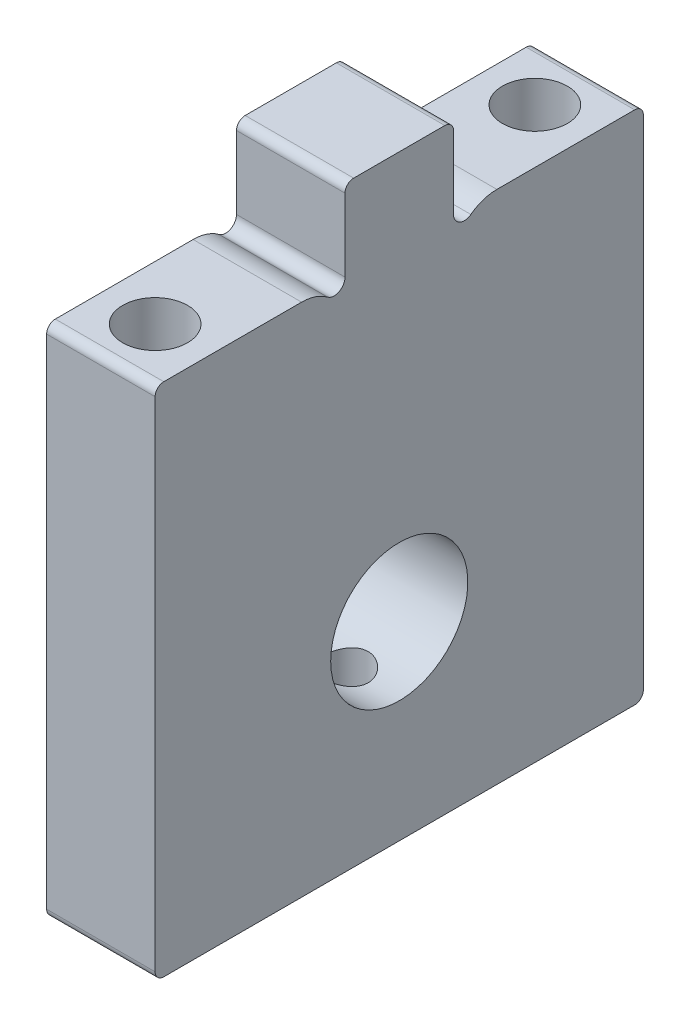
ISO-10303-21;
HEADER;
FILE_DESCRIPTION(('STEP AP214'),'2;1');
FILE_NAME('part.step','',(''),(''),'','','');
FILE_SCHEMA(('AUTOMOTIVE_DESIGN { 1 0 10303 214 1 1 1 1 }'));
ENDSEC;
DATA;
#1=APPLICATION_CONTEXT('core data for automotive mechanical design processes');
#2=APPLICATION_PROTOCOL_DEFINITION('international standard','automotive_design',2000,#1);
#3=PRODUCT_CONTEXT('',#1,'mechanical');
#4=PRODUCT('Part','Part','',(#3));
#5=PRODUCT_RELATED_PRODUCT_CATEGORY('part','',(#4));
#6=PRODUCT_DEFINITION_FORMATION('','',#4);
#7=PRODUCT_DEFINITION_CONTEXT('part definition',#1,'design');
#8=PRODUCT_DEFINITION('design','',#6,#7);
#9=PRODUCT_DEFINITION_SHAPE('','',#8);
#10=(LENGTH_UNIT() NAMED_UNIT(*) SI_UNIT(.MILLI.,.METRE.));
#11=(NAMED_UNIT(*) PLANE_ANGLE_UNIT() SI_UNIT($,.RADIAN.));
#12=(NAMED_UNIT(*) SI_UNIT($,.STERADIAN.) SOLID_ANGLE_UNIT());
#13=UNCERTAINTY_MEASURE_WITH_UNIT(LENGTH_MEASURE(1.E-05),#10,'distance_accuracy_value','');
#14=(GEOMETRIC_REPRESENTATION_CONTEXT(3) GLOBAL_UNCERTAINTY_ASSIGNED_CONTEXT((#13)) GLOBAL_UNIT_ASSIGNED_CONTEXT((#10,
#11,#12)) REPRESENTATION_CONTEXT('',''));
#15=CARTESIAN_POINT('',(0.,0.,0.));
#16=DIRECTION('',(0.,0.,1.));
#17=DIRECTION('',(1.,0.,0.));
#18=AXIS2_PLACEMENT_3D('',#15,#16,#17);
#19=CARTESIAN_POINT('',(0.,19.05,0.));
#20=DIRECTION('',(0.,1.,0.));
#21=DIRECTION('',(0.,0.,1.));
#22=AXIS2_PLACEMENT_3D('',#19,#20,#21);
#23=PLANE('',#22);
#24=DIRECTION('',(0.,0.,-1.));
#25=VECTOR('',#24,1.);
#26=CARTESIAN_POINT('',(-33.3375,19.05,-12.7));
#27=LINE('',#26,#25);
#28=CARTESIAN_POINT('',(-33.3375,19.05,13.7795));
#29=VERTEX_POINT('',#28);
#30=CARTESIAN_POINT('',(-33.3375,19.05,5.715));
#31=VERTEX_POINT('',#30);
#32=EDGE_CURVE('E218',#29,#31,#27,.T.);
#33=ORIENTED_EDGE('',*,*,#32,.F.);
#34=DIRECTION('',(-1.,0.,0.));
#35=VECTOR('',#34,1.);
#36=CARTESIAN_POINT('',(0.,19.05,13.7795));
#37=LINE('',#36,#35);
#38=CARTESIAN_POINT('',(-26.9875,19.05,13.7795));
#39=VERTEX_POINT('',#38);
#40=EDGE_CURVE('E280',#29,#39,#37,.F.);
#41=ORIENTED_EDGE('',*,*,#40,.T.);
#42=DIRECTION('',(0.,0.,1.));
#43=VECTOR('',#42,1.);
#44=CARTESIAN_POINT('',(-26.9875,19.05,-12.7));
#45=LINE('',#44,#43);
#46=CARTESIAN_POINT('',(-26.9875,19.05,5.715));
#47=VERTEX_POINT('',#46);
#48=EDGE_CURVE('E213',#47,#39,#45,.T.);
#49=ORIENTED_EDGE('',*,*,#48,.F.);
#50=DIRECTION('',(1.,0.,0.));
#51=VECTOR('',#50,1.);
#52=CARTESIAN_POINT('',(-33.3375,19.05,5.715));
#53=LINE('',#52,#51);
#54=EDGE_CURVE('E240',#47,#31,#53,.F.);
#55=ORIENTED_EDGE('',*,*,#54,.T.);
#56=EDGE_LOOP('',(#33,#41,#49,#55));
#57=FACE_BOUND('',#56,.T.);
#58=CARTESIAN_POINT('',(-30.1625,19.05,11.1125));
#59=DIRECTION('',(0.,1.,0.));
#60=DIRECTION('',(0.,0.,1.));
#61=AXIS2_PLACEMENT_3D('',#58,#59,#60);
#62=CIRCLE('',#61,1.89865);
#63=CARTESIAN_POINT('',(-30.1625,19.05,13.01115));
#64=VERTEX_POINT('',#63);
#65=EDGE_CURVE('E319',#64,#64,#62,.F.);
#66=ORIENTED_EDGE('',*,*,#65,.T.);
#67=EDGE_LOOP('',(#66));
#68=FACE_BOUND('',#67,.T.);
#69=ADVANCED_FACE('F36',(#57,#68),#23,.T.);
#70=CARTESIAN_POINT('',(-26.9875,-11.1125,-12.7));
#71=DIRECTION('',(-1.,0.,0.));
#72=DIRECTION('',(0.,0.,1.));
#73=AXIS2_PLACEMENT_3D('',#70,#71,#72);
#74=PLANE('',#73);
#75=CARTESIAN_POINT('',(-26.9875,0.,0.));
#76=DIRECTION('',(-1.,0.,0.));
#77=DIRECTION('',(0.,0.,1.));
#78=AXIS2_PLACEMENT_3D('',#75,#76,#77);
#79=CIRCLE('',#78,4.0127);
#80=CARTESIAN_POINT('',(-26.9875,0.,4.0127));
#81=VERTEX_POINT('',#80);
#82=EDGE_CURVE('E343',#81,#81,#79,.T.);
#83=ORIENTED_EDGE('',*,*,#82,.T.);
#84=EDGE_LOOP('',(#83));
#85=FACE_BOUND('',#84,.T.);
#86=DIRECTION('',(0.,-1.,0.));
#87=VECTOR('',#86,1.);
#88=CARTESIAN_POINT('',(-26.9875,19.05,14.2875));
#89=LINE('',#88,#87);
#90=CARTESIAN_POINT('',(-26.9875,18.542,14.2875));
#91=VERTEX_POINT('',#90);
#92=CARTESIAN_POINT('',(-26.9875,-10.6045,14.2875));
#93=VERTEX_POINT('',#92);
#94=EDGE_CURVE('E314',#91,#93,#89,.T.);
#95=ORIENTED_EDGE('',*,*,#94,.T.);
#96=CARTESIAN_POINT('',(-26.9875,-10.6045,13.7795));
#97=DIRECTION('',(-1.,0.,0.));
#98=DIRECTION('',(0.,0.,1.));
#99=AXIS2_PLACEMENT_3D('',#96,#97,#98);
#100=CIRCLE('',#99,0.508);
#101=CARTESIAN_POINT('',(-26.9875,-11.1125,13.7795));
#102=VERTEX_POINT('',#101);
#103=EDGE_CURVE('E274',#93,#102,#100,.F.);
#104=ORIENTED_EDGE('',*,*,#103,.T.);
#105=DIRECTION('',(0.,0.,1.));
#106=VECTOR('',#105,1.);
#107=CARTESIAN_POINT('',(-26.9875,-11.1125,-12.7));
#108=LINE('',#107,#106);
#109=CARTESIAN_POINT('',(-26.9875,-11.1125,-13.7795));
#110=VERTEX_POINT('',#109);
#111=EDGE_CURVE('E214',#110,#102,#108,.T.);
#112=ORIENTED_EDGE('',*,*,#111,.F.);
#113=CARTESIAN_POINT('',(-26.9875,-10.6045,-13.7795));
#114=DIRECTION('',(-1.,0.,0.));
#115=DIRECTION('',(0.,0.,1.));
#116=AXIS2_PLACEMENT_3D('',#113,#114,#115);
#117=CIRCLE('',#116,0.508);
#118=CARTESIAN_POINT('',(-26.9875,-10.6045,-14.2875));
#119=VERTEX_POINT('',#118);
#120=EDGE_CURVE('E64',#110,#119,#117,.F.);
#121=ORIENTED_EDGE('',*,*,#120,.T.);
#122=DIRECTION('',(0.,1.,0.));
#123=VECTOR('',#122,1.);
#124=CARTESIAN_POINT('',(-26.9875,-11.1125,-14.2875));
#125=LINE('',#124,#123);
#126=CARTESIAN_POINT('',(-26.9875,18.542,-14.2875));
#127=VERTEX_POINT('',#126);
#128=EDGE_CURVE('E197',#119,#127,#125,.T.);
#129=ORIENTED_EDGE('',*,*,#128,.T.);
#130=CARTESIAN_POINT('',(-26.9875,18.542,-13.7795));
#131=DIRECTION('',(-1.,0.,0.));
#132=DIRECTION('',(0.,0.,1.));
#133=AXIS2_PLACEMENT_3D('',#130,#131,#132);
#134=CIRCLE('',#133,0.508);
#135=CARTESIAN_POINT('',(-26.9875,19.05,-13.7795));
#136=VERTEX_POINT('',#135);
#137=EDGE_CURVE('E265',#127,#136,#134,.F.);
#138=ORIENTED_EDGE('',*,*,#137,.T.);
#139=CARTESIAN_POINT('',(-26.9875,19.05,-5.715));
#140=VERTEX_POINT('',#139);
#141=EDGE_CURVE('E222',#136,#140,#45,.T.);
#142=ORIENTED_EDGE('',*,*,#141,.T.);
#143=CARTESIAN_POINT('',(-26.9875,16.51,-5.715));
#144=DIRECTION('',(-1.,0.,0.));
#145=DIRECTION('',(0.,0.,1.));
#146=AXIS2_PLACEMENT_3D('',#143,#144,#145);
#147=CIRCLE('',#146,2.54);
#148=CARTESIAN_POINT('',(-26.9875,18.542,-4.191));
#149=VERTEX_POINT('',#148);
#150=EDGE_CURVE('E236',#140,#149,#147,.F.);
#151=ORIENTED_EDGE('',*,*,#150,.T.);
#152=CARTESIAN_POINT('',(-26.9875,19.05,-3.81));
#153=DIRECTION('',(-1.,0.,0.));
#154=DIRECTION('',(0.,0.,1.));
#155=AXIS2_PLACEMENT_3D('',#152,#153,#154);
#156=CIRCLE('',#155,0.635);
#157=CARTESIAN_POINT('',(-26.9875,19.05,-3.175));
#158=VERTEX_POINT('',#157);
#159=EDGE_CURVE('E301',#149,#158,#156,.T.);
#160=ORIENTED_EDGE('',*,*,#159,.T.);
#161=DIRECTION('',(0.,1.,0.));
#162=VECTOR('',#161,1.);
#163=CARTESIAN_POINT('',(-26.9875,23.8125,-3.175));
#164=LINE('',#163,#162);
#165=CARTESIAN_POINT('',(-26.9875,23.3045,-3.175));
#166=VERTEX_POINT('',#165);
#167=EDGE_CURVE('E204',#158,#166,#164,.T.);
#168=ORIENTED_EDGE('',*,*,#167,.T.);
#169=CARTESIAN_POINT('',(-26.9875,23.3045,-2.667));
#170=DIRECTION('',(-1.,0.,0.));
#171=DIRECTION('',(0.,0.,1.));
#172=AXIS2_PLACEMENT_3D('',#169,#170,#171);
#173=CIRCLE('',#172,0.508);
#174=CARTESIAN_POINT('',(-26.9875,23.8125,-2.667));
#175=VERTEX_POINT('',#174);
#176=EDGE_CURVE('E267',#166,#175,#173,.F.);
#177=ORIENTED_EDGE('',*,*,#176,.T.);
#178=DIRECTION('',(0.,0.,1.));
#179=VECTOR('',#178,1.);
#180=CARTESIAN_POINT('',(-26.9875,23.8125,3.175));
#181=LINE('',#180,#179);
#182=CARTESIAN_POINT('',(-26.9875,23.8125,2.667));
#183=VERTEX_POINT('',#182);
#184=EDGE_CURVE('E209',#175,#183,#181,.T.);
#185=ORIENTED_EDGE('',*,*,#184,.T.);
#186=CARTESIAN_POINT('',(-26.9875,23.3045,2.667));
#187=DIRECTION('',(-1.,0.,0.));
#188=DIRECTION('',(0.,0.,1.));
#189=AXIS2_PLACEMENT_3D('',#186,#187,#188);
#190=CIRCLE('',#189,0.508);
#191=CARTESIAN_POINT('',(-26.9875,23.3045,3.175));
#192=VERTEX_POINT('',#191);
#193=EDGE_CURVE('E269',#183,#192,#190,.F.);
#194=ORIENTED_EDGE('',*,*,#193,.T.);
#195=DIRECTION('',(0.,-1.,0.));
#196=VECTOR('',#195,1.);
#197=CARTESIAN_POINT('',(-26.9875,19.05,3.175));
#198=LINE('',#197,#196);
#199=CARTESIAN_POINT('',(-26.9875,19.05,3.175));
#200=VERTEX_POINT('',#199);
#201=EDGE_CURVE('E211',#192,#200,#198,.T.);
#202=ORIENTED_EDGE('',*,*,#201,.T.);
#203=CARTESIAN_POINT('',(-26.9875,19.05,3.81));
#204=DIRECTION('',(-1.,0.,0.));
#205=DIRECTION('',(0.,0.,1.));
#206=AXIS2_PLACEMENT_3D('',#203,#204,#205);
#207=CIRCLE('',#206,0.635);
#208=CARTESIAN_POINT('',(-26.9875,18.542,4.191));
#209=VERTEX_POINT('',#208);
#210=EDGE_CURVE('E177',#200,#209,#207,.T.);
#211=ORIENTED_EDGE('',*,*,#210,.T.);
#212=CARTESIAN_POINT('',(-26.9875,16.51,5.715));
#213=DIRECTION('',(-1.,0.,0.));
#214=DIRECTION('',(0.,0.,1.));
#215=AXIS2_PLACEMENT_3D('',#212,#213,#214);
#216=CIRCLE('',#215,2.54);
#217=EDGE_CURVE('E234',#209,#47,#216,.F.);
#218=ORIENTED_EDGE('',*,*,#217,.T.);
#219=ORIENTED_EDGE('',*,*,#48,.T.);
#220=CARTESIAN_POINT('',(-26.9875,18.542,13.7795));
#221=DIRECTION('',(-1.,0.,0.));
#222=DIRECTION('',(0.,0.,1.));
#223=AXIS2_PLACEMENT_3D('',#220,#221,#222);
#224=CIRCLE('',#223,0.508);
#225=EDGE_CURVE('E271',#39,#91,#224,.F.);
#226=ORIENTED_EDGE('',*,*,#225,.T.);
#227=EDGE_LOOP('',(#95,#104,#112,#121,#129,#138,#142,#151,#160,#168,#177,#185,#194,#202,#211,
#218,#219,#226));
#228=FACE_BOUND('',#227,.T.);
#229=ADVANCED_FACE('F297',(#85,#228),#74,.F.);
#230=CARTESIAN_POINT('',(-33.3375,-11.1125,-12.7));
#231=DIRECTION('',(1.,0.,0.));
#232=DIRECTION('',(0.,0.,-1.));
#233=AXIS2_PLACEMENT_3D('',#230,#231,#232);
#234=PLANE('',#233);
#235=CARTESIAN_POINT('',(-33.3375,0.,0.));
#236=DIRECTION('',(-1.,0.,0.));
#237=DIRECTION('',(0.,0.,1.));
#238=AXIS2_PLACEMENT_3D('',#235,#236,#237);
#239=CIRCLE('',#238,4.0127);
#240=CARTESIAN_POINT('',(-33.3375,0.,4.0127));
#241=VERTEX_POINT('',#240);
#242=EDGE_CURVE('E340',#241,#241,#239,.T.);
#243=ORIENTED_EDGE('',*,*,#242,.F.);
#244=EDGE_LOOP('',(#243));
#245=FACE_BOUND('',#244,.T.);
#246=DIRECTION('',(0.,0.,-1.));
#247=VECTOR('',#246,1.);
#248=CARTESIAN_POINT('',(-33.3375,-11.1125,-12.7));
#249=LINE('',#248,#247);
#250=CARTESIAN_POINT('',(-33.3375,-11.1125,13.7795));
#251=VERTEX_POINT('',#250);
#252=CARTESIAN_POINT('',(-33.3375,-11.1125,-13.7795));
#253=VERTEX_POINT('',#252);
#254=EDGE_CURVE('E217',#251,#253,#249,.T.);
#255=ORIENTED_EDGE('',*,*,#254,.F.);
#256=CARTESIAN_POINT('',(-33.3375,-10.6045,13.7795));
#257=DIRECTION('',(1.,0.,0.));
#258=DIRECTION('',(0.,0.,-1.));
#259=AXIS2_PLACEMENT_3D('',#256,#257,#258);
#260=CIRCLE('',#259,0.508);
#261=CARTESIAN_POINT('',(-33.3375,-10.6045,14.2875));
#262=VERTEX_POINT('',#261);
#263=EDGE_CURVE('E258',#251,#262,#260,.F.);
#264=ORIENTED_EDGE('',*,*,#263,.T.);
#265=DIRECTION('',(0.,1.,0.));
#266=VECTOR('',#265,1.);
#267=CARTESIAN_POINT('',(-33.3375,19.05,14.2875));
#268=LINE('',#267,#266);
#269=CARTESIAN_POINT('',(-33.3375,18.542,14.2875));
#270=VERTEX_POINT('',#269);
#271=EDGE_CURVE('E316',#262,#270,#268,.T.);
#272=ORIENTED_EDGE('',*,*,#271,.T.);
#273=CARTESIAN_POINT('',(-33.3375,18.542,13.7795));
#274=DIRECTION('',(1.,0.,0.));
#275=DIRECTION('',(0.,0.,-1.));
#276=AXIS2_PLACEMENT_3D('',#273,#274,#275);
#277=CIRCLE('',#276,0.508);
#278=EDGE_CURVE('E254',#270,#29,#277,.F.);
#279=ORIENTED_EDGE('',*,*,#278,.T.);
#280=ORIENTED_EDGE('',*,*,#32,.T.);
#281=CARTESIAN_POINT('',(-33.3375,16.51,5.715));
#282=DIRECTION('',(1.,0.,0.));
#283=DIRECTION('',(0.,0.,-1.));
#284=AXIS2_PLACEMENT_3D('',#281,#282,#283);
#285=CIRCLE('',#284,2.54);
#286=CARTESIAN_POINT('',(-33.3375,18.542,4.191));
#287=VERTEX_POINT('',#286);
#288=EDGE_CURVE('E190',#31,#287,#285,.F.);
#289=ORIENTED_EDGE('',*,*,#288,.T.);
#290=CARTESIAN_POINT('',(-33.3375,19.05,3.81));
#291=DIRECTION('',(-1.,0.,0.));
#292=DIRECTION('',(0.,0.,1.));
#293=AXIS2_PLACEMENT_3D('',#290,#291,#292);
#294=CIRCLE('',#293,0.635);
#295=CARTESIAN_POINT('',(-33.3375,19.05,3.175));
#296=VERTEX_POINT('',#295);
#297=EDGE_CURVE('E174',#296,#287,#294,.T.);
#298=ORIENTED_EDGE('',*,*,#297,.F.);
#299=DIRECTION('',(0.,1.,0.));
#300=VECTOR('',#299,1.);
#301=CARTESIAN_POINT('',(-33.3375,19.05,3.175));
#302=LINE('',#301,#300);
#303=CARTESIAN_POINT('',(-33.3375,23.3045,3.175));
#304=VERTEX_POINT('',#303);
#305=EDGE_CURVE('E188',#296,#304,#302,.T.);
#306=ORIENTED_EDGE('',*,*,#305,.T.);
#307=CARTESIAN_POINT('',(-33.3375,23.3045,2.667));
#308=DIRECTION('',(1.,0.,0.));
#309=DIRECTION('',(0.,0.,-1.));
#310=AXIS2_PLACEMENT_3D('',#307,#308,#309);
#311=CIRCLE('',#310,0.508);
#312=CARTESIAN_POINT('',(-33.3375,23.8125,2.667));
#313=VERTEX_POINT('',#312);
#314=EDGE_CURVE('E252',#304,#313,#311,.F.);
#315=ORIENTED_EDGE('',*,*,#314,.T.);
#316=DIRECTION('',(0.,0.,-1.));
#317=VECTOR('',#316,1.);
#318=CARTESIAN_POINT('',(-33.3375,23.8125,3.175));
#319=LINE('',#318,#317);
#320=CARTESIAN_POINT('',(-33.3375,23.8125,-2.667));
#321=VERTEX_POINT('',#320);
#322=EDGE_CURVE('E196',#313,#321,#319,.T.);
#323=ORIENTED_EDGE('',*,*,#322,.T.);
#324=CARTESIAN_POINT('',(-33.3375,23.3045,-2.667));
#325=DIRECTION('',(1.,0.,0.));
#326=DIRECTION('',(0.,0.,-1.));
#327=AXIS2_PLACEMENT_3D('',#324,#325,#326);
#328=CIRCLE('',#327,0.508);
#329=CARTESIAN_POINT('',(-33.3375,23.3045,-3.175));
#330=VERTEX_POINT('',#329);
#331=EDGE_CURVE('E250',#321,#330,#328,.F.);
#332=ORIENTED_EDGE('',*,*,#331,.T.);
#333=DIRECTION('',(0.,-1.,0.));
#334=VECTOR('',#333,1.);
#335=CARTESIAN_POINT('',(-33.3375,23.8125,-3.175));
#336=LINE('',#335,#334);
#337=CARTESIAN_POINT('',(-33.3375,19.05,-3.175));
#338=VERTEX_POINT('',#337);
#339=EDGE_CURVE('E182',#330,#338,#336,.T.);
#340=ORIENTED_EDGE('',*,*,#339,.T.);
#341=CARTESIAN_POINT('',(-33.3375,19.05,-3.81));
#342=DIRECTION('',(-1.,0.,0.));
#343=DIRECTION('',(0.,0.,1.));
#344=AXIS2_PLACEMENT_3D('',#341,#342,#343);
#345=CIRCLE('',#344,0.635);
#346=CARTESIAN_POINT('',(-33.3375,18.542,-4.191));
#347=VERTEX_POINT('',#346);
#348=EDGE_CURVE('E336',#347,#338,#345,.T.);
#349=ORIENTED_EDGE('',*,*,#348,.F.);
#350=CARTESIAN_POINT('',(-33.3375,16.51,-5.715));
#351=DIRECTION('',(1.,0.,0.));
#352=DIRECTION('',(0.,0.,-1.));
#353=AXIS2_PLACEMENT_3D('',#350,#351,#352);
#354=CIRCLE('',#353,2.54);
#355=CARTESIAN_POINT('',(-33.3375,19.05,-5.715));
#356=VERTEX_POINT('',#355);
#357=EDGE_CURVE('E229',#347,#356,#354,.F.);
#358=ORIENTED_EDGE('',*,*,#357,.T.);
#359=CARTESIAN_POINT('',(-33.3375,19.05,-13.7795));
#360=VERTEX_POINT('',#359);
#361=EDGE_CURVE('E224',#356,#360,#27,.T.);
#362=ORIENTED_EDGE('',*,*,#361,.T.);
#363=CARTESIAN_POINT('',(-33.3375,18.542,-13.7795));
#364=DIRECTION('',(1.,0.,0.));
#365=DIRECTION('',(0.,0.,-1.));
#366=AXIS2_PLACEMENT_3D('',#363,#364,#365);
#367=CIRCLE('',#366,0.508);
#368=CARTESIAN_POINT('',(-33.3375,18.542,-14.2875));
#369=VERTEX_POINT('',#368);
#370=EDGE_CURVE('E248',#360,#369,#367,.F.);
#371=ORIENTED_EDGE('',*,*,#370,.T.);
#372=DIRECTION('',(0.,-1.,0.));
#373=VECTOR('',#372,1.);
#374=CARTESIAN_POINT('',(-33.3375,-11.1125,-14.2875));
#375=LINE('',#374,#373);
#376=CARTESIAN_POINT('',(-33.3375,-10.6045,-14.2875));
#377=VERTEX_POINT('',#376);
#378=EDGE_CURVE('E201',#369,#377,#375,.T.);
#379=ORIENTED_EDGE('',*,*,#378,.T.);
#380=CARTESIAN_POINT('',(-33.3375,-10.6045,-13.7795));
#381=DIRECTION('',(1.,0.,0.));
#382=DIRECTION('',(0.,0.,-1.));
#383=AXIS2_PLACEMENT_3D('',#380,#381,#382);
#384=CIRCLE('',#383,0.508);
#385=EDGE_CURVE('E256',#377,#253,#384,.F.);
#386=ORIENTED_EDGE('',*,*,#385,.T.);
#387=EDGE_LOOP('',(#255,#264,#272,#279,#280,#289,#298,#306,#315,#323,#332,#340,#349,#358,#362,
#371,#379,#386));
#388=FACE_BOUND('',#387,.T.);
#389=ADVANCED_FACE('F187',(#245,#388),#234,.F.);
#390=CARTESIAN_POINT('',(0.,-11.1125,0.));
#391=DIRECTION('',(0.,1.,0.));
#392=DIRECTION('',(0.,0.,1.));
#393=AXIS2_PLACEMENT_3D('',#390,#391,#392);
#394=PLANE('',#393);
#395=CARTESIAN_POINT('',(-30.1625,-11.1125,0.));
#396=DIRECTION('',(0.,-1.,0.));
#397=DIRECTION('',(0.,0.,-1.));
#398=AXIS2_PLACEMENT_3D('',#395,#396,#397);
#399=CIRCLE('',#398,1.35255);
#400=CARTESIAN_POINT('',(-30.1625,-11.1125,-1.35255));
#401=VERTEX_POINT('',#400);
#402=EDGE_CURVE('E328',#401,#401,#399,.T.);
#403=ORIENTED_EDGE('',*,*,#402,.F.);
#404=EDGE_LOOP('',(#403));
#405=FACE_BOUND('',#404,.T.);
#406=CARTESIAN_POINT('',(-30.1625,-11.1125,11.1125));
#407=DIRECTION('',(0.,-1.,0.));
#408=DIRECTION('',(0.,0.,-1.));
#409=AXIS2_PLACEMENT_3D('',#406,#407,#408);
#410=CIRCLE('',#409,1.89865);
#411=CARTESIAN_POINT('',(-30.1625,-11.1125,9.21385));
#412=VERTEX_POINT('',#411);
#413=EDGE_CURVE('E324',#412,#412,#410,.T.);
#414=ORIENTED_EDGE('',*,*,#413,.F.);
#415=EDGE_LOOP('',(#414));
#416=FACE_BOUND('',#415,.T.);
#417=CARTESIAN_POINT('',(-30.1625,-11.1125,-11.1125));
#418=DIRECTION('',(0.,-1.,0.));
#419=DIRECTION('',(0.,0.,-1.));
#420=AXIS2_PLACEMENT_3D('',#417,#418,#419);
#421=CIRCLE('',#420,1.89865);
#422=CARTESIAN_POINT('',(-30.1625,-11.1125,-13.01115));
#423=VERTEX_POINT('',#422);
#424=EDGE_CURVE('E325',#423,#423,#421,.T.);
#425=ORIENTED_EDGE('',*,*,#424,.F.);
#426=EDGE_LOOP('',(#425));
#427=FACE_BOUND('',#426,.T.);
#428=ORIENTED_EDGE('',*,*,#111,.T.);
#429=DIRECTION('',(-1.,0.,0.));
#430=VECTOR('',#429,1.);
#431=CARTESIAN_POINT('',(-33.3375,-11.1125,13.7795));
#432=LINE('',#431,#430);
#433=EDGE_CURVE('E245',#102,#251,#432,.T.);
#434=ORIENTED_EDGE('',*,*,#433,.T.);
#435=ORIENTED_EDGE('',*,*,#254,.T.);
#436=DIRECTION('',(-1.,0.,0.));
#437=VECTOR('',#436,1.);
#438=CARTESIAN_POINT('',(-26.9875,-11.1125,-13.7795));
#439=LINE('',#438,#437);
#440=EDGE_CURVE('E243',#253,#110,#439,.F.);
#441=ORIENTED_EDGE('',*,*,#440,.T.);
#442=EDGE_LOOP('',(#428,#434,#435,#441));
#443=FACE_BOUND('',#442,.T.);
#444=ADVANCED_FACE('F376',(#405,#416,#427,#443),#394,.F.);
#445=ORIENTED_EDGE('',*,*,#141,.F.);
#446=DIRECTION('',(-1.,0.,0.));
#447=VECTOR('',#446,1.);
#448=CARTESIAN_POINT('',(0.,19.05,-13.7795));
#449=LINE('',#448,#447);
#450=EDGE_CURVE('E11',#136,#360,#449,.T.);
#451=ORIENTED_EDGE('',*,*,#450,.T.);
#452=ORIENTED_EDGE('',*,*,#361,.F.);
#453=DIRECTION('',(1.,0.,0.));
#454=VECTOR('',#453,1.);
#455=CARTESIAN_POINT('',(-26.9875,19.05,-5.715));
#456=LINE('',#455,#454);
#457=EDGE_CURVE('E231',#356,#140,#456,.T.);
#458=ORIENTED_EDGE('',*,*,#457,.T.);
#459=EDGE_LOOP('',(#445,#451,#452,#458));
#460=FACE_BOUND('',#459,.T.);
#461=CARTESIAN_POINT('',(-30.1625,19.05,-11.1125));
#462=DIRECTION('',(0.,1.,0.));
#463=DIRECTION('',(0.,0.,1.));
#464=AXIS2_PLACEMENT_3D('',#461,#462,#463);
#465=CIRCLE('',#464,1.89865);
#466=CARTESIAN_POINT('',(-30.1625,19.05,-9.21384999999999));
#467=VERTEX_POINT('',#466);
#468=EDGE_CURVE('E321',#467,#467,#465,.F.);
#469=ORIENTED_EDGE('',*,*,#468,.T.);
#470=EDGE_LOOP('',(#469));
#471=FACE_BOUND('',#470,.T.);
#472=ADVANCED_FACE('F366',(#460,#471),#23,.T.);
#473=CARTESIAN_POINT('',(-19.05,23.8125,-3.175));
#474=DIRECTION('',(0.,0.,-1.));
#475=DIRECTION('',(-1.,0.,0.));
#476=AXIS2_PLACEMENT_3D('',#473,#474,#475);
#477=PLANE('',#476);
#478=ORIENTED_EDGE('',*,*,#339,.F.);
#479=DIRECTION('',(-1.,0.,0.));
#480=VECTOR('',#479,1.);
#481=CARTESIAN_POINT('',(-19.05,23.3045,-3.175));
#482=LINE('',#481,#480);
#483=EDGE_CURVE('E50',#330,#166,#482,.F.);
#484=ORIENTED_EDGE('',*,*,#483,.T.);
#485=ORIENTED_EDGE('',*,*,#167,.F.);
#486=DIRECTION('',(-1.,0.,0.));
#487=VECTOR('',#486,1.);
#488=CARTESIAN_POINT('',(-19.05,19.05,-3.175));
#489=LINE('',#488,#487);
#490=EDGE_CURVE('E181',#158,#338,#489,.T.);
#491=ORIENTED_EDGE('',*,*,#490,.T.);
#492=EDGE_LOOP('',(#478,#484,#485,#491));
#493=FACE_BOUND('',#492,.T.);
#494=ADVANCED_FACE('F293',(#493),#477,.T.);
#495=CARTESIAN_POINT('',(-19.05,23.8125,3.175));
#496=DIRECTION('',(0.,1.,0.));
#497=DIRECTION('',(0.,0.,1.));
#498=AXIS2_PLACEMENT_3D('',#495,#496,#497);
#499=PLANE('',#498);
#500=ORIENTED_EDGE('',*,*,#322,.F.);
#501=DIRECTION('',(-1.,0.,0.));
#502=VECTOR('',#501,1.);
#503=CARTESIAN_POINT('',(-19.05,23.8125,2.667));
#504=LINE('',#503,#502);
#505=EDGE_CURVE('E286',#313,#183,#504,.F.);
#506=ORIENTED_EDGE('',*,*,#505,.T.);
#507=ORIENTED_EDGE('',*,*,#184,.F.);
#508=DIRECTION('',(-1.,0.,0.));
#509=VECTOR('',#508,1.);
#510=CARTESIAN_POINT('',(-19.05,23.8125,-2.667));
#511=LINE('',#510,#509);
#512=EDGE_CURVE('E283',#175,#321,#511,.T.);
#513=ORIENTED_EDGE('',*,*,#512,.T.);
#514=EDGE_LOOP('',(#500,#506,#507,#513));
#515=FACE_BOUND('',#514,.T.);
#516=ADVANCED_FACE('F307',(#515),#499,.T.);
#517=CARTESIAN_POINT('',(-19.05,19.05,3.175));
#518=DIRECTION('',(0.,0.,1.));
#519=DIRECTION('',(1.,0.,0.));
#520=AXIS2_PLACEMENT_3D('',#517,#518,#519);
#521=PLANE('',#520);
#522=ORIENTED_EDGE('',*,*,#201,.F.);
#523=DIRECTION('',(-1.,0.,0.));
#524=VECTOR('',#523,1.);
#525=CARTESIAN_POINT('',(-19.05,23.3045,3.175));
#526=LINE('',#525,#524);
#527=EDGE_CURVE('E195',#192,#304,#526,.T.);
#528=ORIENTED_EDGE('',*,*,#527,.T.);
#529=ORIENTED_EDGE('',*,*,#305,.F.);
#530=DIRECTION('',(-1.,0.,0.));
#531=VECTOR('',#530,1.);
#532=CARTESIAN_POINT('',(-19.05,19.05,3.175));
#533=LINE('',#532,#531);
#534=EDGE_CURVE('E170',#200,#296,#533,.T.);
#535=ORIENTED_EDGE('',*,*,#534,.F.);
#536=EDGE_LOOP('',(#522,#528,#529,#535));
#537=FACE_BOUND('',#536,.T.);
#538=ADVANCED_FACE('F193',(#537),#521,.T.);
#539=CARTESIAN_POINT('',(3.21674742482421,-11.1125,-14.2875));
#540=DIRECTION('',(0.,0.,-1.));
#541=DIRECTION('',(0.,1.,0.));
#542=AXIS2_PLACEMENT_3D('',#539,#540,#541);
#543=PLANE('',#542);
#544=ORIENTED_EDGE('',*,*,#128,.F.);
#545=DIRECTION('',(-1.,0.,0.));
#546=VECTOR('',#545,1.);
#547=CARTESIAN_POINT('',(-33.3375,-10.6045,-14.2875));
#548=LINE('',#547,#546);
#549=EDGE_CURVE('E277',#119,#377,#548,.T.);
#550=ORIENTED_EDGE('',*,*,#549,.T.);
#551=ORIENTED_EDGE('',*,*,#378,.F.);
#552=DIRECTION('',(-1.,0.,0.));
#553=VECTOR('',#552,1.);
#554=CARTESIAN_POINT('',(3.21674742482421,18.542,-14.2875));
#555=LINE('',#554,#553);
#556=EDGE_CURVE('E57',#369,#127,#555,.F.);
#557=ORIENTED_EDGE('',*,*,#556,.T.);
#558=EDGE_LOOP('',(#544,#550,#551,#557));
#559=FACE_BOUND('',#558,.T.);
#560=ADVANCED_FACE('F401',(#559),#543,.T.);
#561=CARTESIAN_POINT('',(3.21674742482421,19.05,14.2875));
#562=DIRECTION('',(0.,0.,1.));
#563=DIRECTION('',(0.,-1.,0.));
#564=AXIS2_PLACEMENT_3D('',#561,#562,#563);
#565=PLANE('',#564);
#566=ORIENTED_EDGE('',*,*,#271,.F.);
#567=DIRECTION('',(-1.,0.,0.));
#568=VECTOR('',#567,1.);
#569=CARTESIAN_POINT('',(-26.9875,-10.6045,14.2875));
#570=LINE('',#569,#568);
#571=EDGE_CURVE('E263',#262,#93,#570,.F.);
#572=ORIENTED_EDGE('',*,*,#571,.T.);
#573=ORIENTED_EDGE('',*,*,#94,.F.);
#574=DIRECTION('',(-1.,0.,0.));
#575=VECTOR('',#574,1.);
#576=CARTESIAN_POINT('',(3.21674742482421,18.542,14.2875));
#577=LINE('',#576,#575);
#578=EDGE_CURVE('E260',#91,#270,#577,.T.);
#579=ORIENTED_EDGE('',*,*,#578,.T.);
#580=EDGE_LOOP('',(#566,#572,#573,#579));
#581=FACE_BOUND('',#580,.T.);
#582=ADVANCED_FACE('F392',(#581),#565,.T.);
#583=CARTESIAN_POINT('',(-30.1625,24.4201931603994,-11.1125));
#584=DIRECTION('',(0.,-1.,0.));
#585=DIRECTION('',(0.,0.,-1.));
#586=AXIS2_PLACEMENT_3D('',#583,#584,#585);
#587=CYLINDRICAL_SURFACE('',#586,1.89865);
#588=ORIENTED_EDGE('',*,*,#424,.T.);
#589=EDGE_LOOP('',(#588));
#590=FACE_BOUND('',#589,.T.);
#591=ORIENTED_EDGE('',*,*,#468,.F.);
#592=EDGE_LOOP('',(#591));
#593=FACE_BOUND('',#592,.T.);
#594=ADVANCED_FACE('F389',(#590,#593),#587,.F.);
#595=CARTESIAN_POINT('',(-30.1625,24.4201931603994,11.1125));
#596=DIRECTION('',(0.,-1.,0.));
#597=DIRECTION('',(0.,0.,-1.));
#598=AXIS2_PLACEMENT_3D('',#595,#596,#597);
#599=CYLINDRICAL_SURFACE('',#598,1.89865);
#600=ORIENTED_EDGE('',*,*,#413,.T.);
#601=EDGE_LOOP('',(#600));
#602=FACE_BOUND('',#601,.T.);
#603=ORIENTED_EDGE('',*,*,#65,.F.);
#604=EDGE_LOOP('',(#603));
#605=FACE_BOUND('',#604,.T.);
#606=ADVANCED_FACE('F391',(#602,#605),#599,.F.);
#607=CARTESIAN_POINT('',(-30.1625,66.676,0.));
#608=DIRECTION('',(0.,-1.,0.));
#609=DIRECTION('',(0.,0.,-1.));
#610=AXIS2_PLACEMENT_3D('',#607,#608,#609);
#611=CYLINDRICAL_SURFACE('',#610,1.35255);
#612=CARTESIAN_POINT('',(-30.1625,-3.77787900646646,-1.35255));
#613=CARTESIAN_POINT('',(-30.2361180683741,-3.7778786109251,-1.35255052256224));
#614=CARTESIAN_POINT('',(-30.3097326970197,-3.78005436489309,-1.3465192563408));
#615=CARTESIAN_POINT('',(-30.4547776957295,-3.78847577865725,-1.32263728180805));
#616=CARTESIAN_POINT('',(-30.5262077449876,-3.79472203323183,-1.3047848461904));
#617=CARTESIAN_POINT('',(-30.6647582331139,-3.81049829494776,-1.25796152167692));
#618=CARTESIAN_POINT('',(-30.7318869628745,-3.82002174462738,-1.22901282263397));
#619=CARTESIAN_POINT('',(-30.8603571885956,-3.8412697187707,-1.16089476385696));
#620=CARTESIAN_POINT('',(-30.9216973588688,-3.85299474560707,-1.12172307056508));
#621=CARTESIAN_POINT('',(-31.0393039674973,-3.87785093559209,-1.03259180304855));
#622=CARTESIAN_POINT('',(-31.0953050675747,-3.89101771100114,-0.98229196610281));
#623=CARTESIAN_POINT('',(-31.1982584525623,-3.91697316253251,-0.873058048733172));
#624=CARTESIAN_POINT('',(-31.2452092471812,-3.92976177609083,-0.814122549103536));
#625=CARTESIAN_POINT('',(-31.3299394511363,-3.95393323010755,-0.687343650678143));
#626=CARTESIAN_POINT('',(-31.3674399599003,-3.9652693204877,-0.619304152495328));
#627=CARTESIAN_POINT('',(-31.4303579359737,-3.98483813715005,-0.47743491338282));
#628=CARTESIAN_POINT('',(-31.455778737877,-3.99307171974711,-0.403606776966048));
#629=CARTESIAN_POINT('',(-31.4929132964712,-4.00525552444959,-0.255038641694918));
#630=CARTESIAN_POINT('',(-31.5050817899752,-4.00934748332732,-0.180424145470432));
#631=CARTESIAN_POINT('',(-31.5168131602273,-4.01329058178001,-0.0301076557738073));
#632=CARTESIAN_POINT('',(-31.5163793575931,-4.01314283848728,0.0455940459726466));
#633=CARTESIAN_POINT('',(-31.503204876334,-4.00871872806809,0.192713915240103));
#634=CARTESIAN_POINT('',(-31.4909583144525,-4.00460812729605,0.264182135922487));
#635=CARTESIAN_POINT('',(-31.4553242636703,-3.99292908769165,0.403982256895799));
#636=CARTESIAN_POINT('',(-31.4319360154534,-3.98536041318978,0.472313943080943));
#637=CARTESIAN_POINT('',(-31.3743992250853,-3.96740663161926,0.604970785372674));
#638=CARTESIAN_POINT('',(-31.3401117729646,-3.95698542153341,0.669230604655834));
#639=CARTESIAN_POINT('',(-31.2618650016169,-3.93440877618647,0.791229179067186));
#640=CARTESIAN_POINT('',(-31.2179029508292,-3.92225285148131,0.848966085511437));
#641=CARTESIAN_POINT('',(-31.1190740114533,-3.89679605370411,0.959217174001369));
#642=CARTESIAN_POINT('',(-31.0637844798654,-3.88346823207468,1.01134683451329));
#643=CARTESIAN_POINT('',(-30.9451371484642,-3.8576603162777,1.10572046718224));
#644=CARTESIAN_POINT('',(-30.8817780487586,-3.84518035918677,1.14796284352106));
#645=CARTESIAN_POINT('',(-30.7475465931543,-3.82233170384993,1.22191150626165));
#646=CARTESIAN_POINT('',(-30.6765765414743,-3.81199715224504,1.25345181521585));
#647=CARTESIAN_POINT('',(-30.5298962943816,-3.79500445947811,1.30400232020253));
#648=CARTESIAN_POINT('',(-30.4541881547591,-3.78834473600485,1.32301790982546));
#649=CARTESIAN_POINT('',(-30.3039124803887,-3.77981506697318,1.34718856472638));
#650=CARTESIAN_POINT('',(-30.2294527501591,-3.77773883060424,1.35294113080942));
#651=CARTESIAN_POINT('',(-30.0806186173531,-3.77803393019266,1.35211767572072));
#652=CARTESIAN_POINT('',(-30.006244201428,-3.78040443482072,1.3455439589784));
#653=CARTESIAN_POINT('',(-29.8624382065661,-3.78911991881146,1.32079189865399));
#654=CARTESIAN_POINT('',(-29.7929248542153,-3.79532123150318,1.30303259574297));
#655=CARTESIAN_POINT('',(-29.6578800645552,-3.81084049397456,1.25691837464778));
#656=CARTESIAN_POINT('',(-29.592349345587,-3.82015900403814,1.2285615515618));
#657=CARTESIAN_POINT('',(-29.4647868252108,-3.84123469995622,1.16101845753317));
#658=CARTESIAN_POINT('',(-29.4029360634166,-3.85306085161331,1.12151237911535));
#659=CARTESIAN_POINT('',(-29.2865259507101,-3.8776870843547,1.03315267805091));
#660=CARTESIAN_POINT('',(-29.2319688040447,-3.89048745803854,0.984296240374843));
#661=CARTESIAN_POINT('',(-29.1289096246567,-3.916384293673,0.875758935578999));
#662=CARTESIAN_POINT('',(-29.0808395510534,-3.9294641704655,0.81566272755232));
#663=CARTESIAN_POINT('',(-28.9954362736195,-3.9538244559466,0.687934822802484));
#664=CARTESIAN_POINT('',(-28.9581027143685,-3.96510492419712,0.62030337562791));
#665=CARTESIAN_POINT('',(-28.8955685667359,-3.98454568401859,0.479742373512319));
#666=CARTESIAN_POINT('',(-28.8702912168236,-3.99272564599557,0.406849835213127));
#667=CARTESIAN_POINT('',(-28.8324612783186,-4.00512788674843,0.257517560911879));
#668=CARTESIAN_POINT('',(-28.8199039812555,-4.00935162991948,0.181079148420211));
#669=CARTESIAN_POINT('',(-28.8083018529877,-4.01325253926304,0.0307716281690662));
#670=CARTESIAN_POINT('',(-28.8086375404195,-4.01313814738258,-0.0430447637761426));
#671=CARTESIAN_POINT('',(-28.8212781508715,-4.00889143254063,-0.189520451000439));
#672=CARTESIAN_POINT('',(-28.8335820657642,-4.00475944799569,-0.262179843213919));
#673=CARTESIAN_POINT('',(-28.869396315983,-3.99302001406179,-0.403079522763796));
#674=CARTESIAN_POINT('',(-28.8927178323786,-3.98547120996471,-0.471373041678885));
#675=CARTESIAN_POINT('',(-28.9497294771247,-3.96767577802479,-0.603102714152274));
#676=CARTESIAN_POINT('',(-28.9834214947496,-3.95742865865819,-0.66653798001324));
#677=CARTESIAN_POINT('',(-29.0616694720526,-3.9348120022248,-0.789342509625204));
#678=CARTESIAN_POINT('',(-29.1065851519406,-3.92237733294062,-0.848470407951005));
#679=CARTESIAN_POINT('',(-29.2053975728763,-3.8969396258622,-0.958551302399136));
#680=CARTESIAN_POINT('',(-29.2592972118926,-3.88393640567132,-1.00950165023361));
#681=CARTESIAN_POINT('',(-29.3771425227192,-3.85820220383911,-1.10386981972229));
#682=CARTESIAN_POINT('',(-29.4414054154729,-3.84550328951602,-1.14690152918302));
#683=CARTESIAN_POINT('',(-29.5766476142306,-3.82245533917684,-1.22152740757577));
#684=CARTESIAN_POINT('',(-29.6476253491253,-3.81210575539175,-1.25312424368158));
#685=CARTESIAN_POINT('',(-29.7915783346077,-3.79539753030375,-1.30283732886446));
#686=CARTESIAN_POINT('',(-29.8643772183567,-3.78890306137814,-1.32141716037626));
#687=CARTESIAN_POINT('',(-30.0122858324611,-3.7801447759018,-1.34627097603553));
#688=CARTESIAN_POINT('',(-30.0873947062858,-3.77787940999851,-1.352549466881));
#689=CARTESIAN_POINT('',(-30.1625,-3.77787900646646,-1.35255));
#690=B_SPLINE_CURVE_WITH_KNOTS('',3,(#612,#613,#614,#615,#616,#617,#618,#619,#620,#621,#622,
#623,#624,#625,#626,#627,#628,#629,#630,#631,#632,#633,#634,#635,#636,#637,#638,#639,#640,#641,
#642,#643,#644,#645,#646,#647,#648,#649,#650,#651,#652,#653,#654,#655,#656,#657,#658,#659,#660,
#661,#662,#663,#664,#665,#666,#667,#668,#669,#670,#671,#672,#673,#674,#675,#676,#677,#678,#679,
#680,#681,#682,#683,#684,#685,#686,#687,#688,#689),.UNSPECIFIED.,.T.,.F.,(4,2,2,2,2,2,2,2,2,2,2,
2,2,2,2,2,2,2,2,2,2,2,2,2,2,2,2,2,2,2,2,2,2,2,2,2,2,2,4),(0.,0.220575943680415,
0.441184124977573,0.661353425458418,0.88157302703906,1.10979433000521,1.33805318156764,
1.57241736714209,1.80671681902087,2.03269522928233,2.25861409633683,2.47547520102103,
2.69235108710711,2.91211003645351,3.13193111311294,3.36232003081033,3.59274610792229,
3.8265979424911,4.06034900617061,4.28334455488736,4.50629841818479,4.721359733894,
4.93645972543324,5.15849790220028,5.38060303148026,5.6136742814795,5.84673781502534,
6.07829694782165,6.30977033504904,6.53013647890103,6.75048406211267,6.96718522296782,
7.18392588533809,7.40878657081864,7.63371993080904,7.86771430624223,8.10165406746999,
8.32676855374783,8.55180055203699),.UNSPECIFIED.);
#691=CARTESIAN_POINT('',(-30.1625,-3.77787900646646,-1.35255));
#692=VERTEX_POINT('',#691);
#693=EDGE_CURVE('E40',#692,#692,#690,.T.);
#694=ORIENTED_EDGE('',*,*,#693,.T.);
#695=EDGE_LOOP('',(#694));
#696=FACE_BOUND('',#695,.T.);
#697=ORIENTED_EDGE('',*,*,#402,.T.);
#698=EDGE_LOOP('',(#697));
#699=FACE_BOUND('',#698,.T.);
#700=ADVANCED_FACE('F350',(#696,#699),#611,.F.);
#701=CARTESIAN_POINT('',(-26.9875,19.05,3.81));
#702=DIRECTION('',(-1.,0.,0.));
#703=DIRECTION('',(0.,0.,1.));
#704=AXIS2_PLACEMENT_3D('',#701,#702,#703);
#705=CYLINDRICAL_SURFACE('',#704,0.635);
#706=ORIENTED_EDGE('',*,*,#297,.T.);
#707=DIRECTION('',(-1.,0.,0.));
#708=VECTOR('',#707,1.);
#709=CARTESIAN_POINT('',(-26.9875,18.542,4.191));
#710=LINE('',#709,#708);
#711=EDGE_CURVE('E238',#287,#209,#710,.F.);
#712=ORIENTED_EDGE('',*,*,#711,.T.);
#713=ORIENTED_EDGE('',*,*,#210,.F.);
#714=ORIENTED_EDGE('',*,*,#534,.T.);
#715=EDGE_LOOP('',(#706,#712,#713,#714));
#716=FACE_BOUND('',#715,.T.);
#717=ADVANCED_FACE('F172',(#716),#705,.F.);
#718=CARTESIAN_POINT('',(-26.9875,19.05,-3.81));
#719=DIRECTION('',(-1.,0.,0.));
#720=DIRECTION('',(0.,0.,1.));
#721=AXIS2_PLACEMENT_3D('',#718,#719,#720);
#722=CYLINDRICAL_SURFACE('',#721,0.635);
#723=ORIENTED_EDGE('',*,*,#159,.F.);
#724=DIRECTION('',(-1.,0.,0.));
#725=VECTOR('',#724,1.);
#726=CARTESIAN_POINT('',(-26.9875,18.542,-4.191));
#727=LINE('',#726,#725);
#728=EDGE_CURVE('E221',#149,#347,#727,.T.);
#729=ORIENTED_EDGE('',*,*,#728,.T.);
#730=ORIENTED_EDGE('',*,*,#348,.T.);
#731=ORIENTED_EDGE('',*,*,#490,.F.);
#732=EDGE_LOOP('',(#723,#729,#730,#731));
#733=FACE_BOUND('',#732,.T.);
#734=ADVANCED_FACE('F516',(#733),#722,.F.);
#735=CARTESIAN_POINT('',(-26.9875,16.51,-5.715));
#736=DIRECTION('',(-1.,0.,0.));
#737=DIRECTION('',(0.,0.,1.));
#738=AXIS2_PLACEMENT_3D('',#735,#736,#737);
#739=CYLINDRICAL_SURFACE('',#738,2.54);
#740=ORIENTED_EDGE('',*,*,#150,.F.);
#741=ORIENTED_EDGE('',*,*,#457,.F.);
#742=ORIENTED_EDGE('',*,*,#357,.F.);
#743=ORIENTED_EDGE('',*,*,#728,.F.);
#744=EDGE_LOOP('',(#740,#741,#742,#743));
#745=FACE_BOUND('',#744,.T.);
#746=ADVANCED_FACE('F523',(#745),#739,.T.);
#747=CARTESIAN_POINT('',(-26.9875,16.51,5.715));
#748=DIRECTION('',(-1.,0.,0.));
#749=DIRECTION('',(0.,0.,1.));
#750=AXIS2_PLACEMENT_3D('',#747,#748,#749);
#751=CYLINDRICAL_SURFACE('',#750,2.54);
#752=ORIENTED_EDGE('',*,*,#288,.F.);
#753=ORIENTED_EDGE('',*,*,#54,.F.);
#754=ORIENTED_EDGE('',*,*,#217,.F.);
#755=ORIENTED_EDGE('',*,*,#711,.F.);
#756=EDGE_LOOP('',(#752,#753,#754,#755));
#757=FACE_BOUND('',#756,.T.);
#758=ADVANCED_FACE('F433',(#757),#751,.T.);
#759=CARTESIAN_POINT('',(0.,-10.6045,13.7795));
#760=DIRECTION('',(1.,0.,0.));
#761=DIRECTION('',(0.,0.,-1.));
#762=AXIS2_PLACEMENT_3D('',#759,#760,#761);
#763=CYLINDRICAL_SURFACE('',#762,0.508);
#764=ORIENTED_EDGE('',*,*,#103,.F.);
#765=ORIENTED_EDGE('',*,*,#571,.F.);
#766=ORIENTED_EDGE('',*,*,#263,.F.);
#767=ORIENTED_EDGE('',*,*,#433,.F.);
#768=EDGE_LOOP('',(#764,#765,#766,#767));
#769=FACE_BOUND('',#768,.T.);
#770=ADVANCED_FACE('F427',(#769),#763,.T.);
#771=CARTESIAN_POINT('',(3.21674742482421,-10.6045,-13.7795));
#772=DIRECTION('',(1.,0.,0.));
#773=DIRECTION('',(0.,0.,-1.));
#774=AXIS2_PLACEMENT_3D('',#771,#772,#773);
#775=CYLINDRICAL_SURFACE('',#774,0.508);
#776=ORIENTED_EDGE('',*,*,#120,.F.);
#777=ORIENTED_EDGE('',*,*,#440,.F.);
#778=ORIENTED_EDGE('',*,*,#385,.F.);
#779=ORIENTED_EDGE('',*,*,#549,.F.);
#780=EDGE_LOOP('',(#776,#777,#778,#779));
#781=FACE_BOUND('',#780,.T.);
#782=ADVANCED_FACE('F432',(#781),#775,.T.);
#783=CARTESIAN_POINT('',(3.21674742482421,18.542,13.7795));
#784=DIRECTION('',(-1.,0.,0.));
#785=DIRECTION('',(0.,0.,1.));
#786=AXIS2_PLACEMENT_3D('',#783,#784,#785);
#787=CYLINDRICAL_SURFACE('',#786,0.508);
#788=ORIENTED_EDGE('',*,*,#225,.F.);
#789=ORIENTED_EDGE('',*,*,#40,.F.);
#790=ORIENTED_EDGE('',*,*,#278,.F.);
#791=ORIENTED_EDGE('',*,*,#578,.F.);
#792=EDGE_LOOP('',(#788,#789,#790,#791));
#793=FACE_BOUND('',#792,.T.);
#794=ADVANCED_FACE('F445',(#793),#787,.T.);
#795=CARTESIAN_POINT('',(-19.05,23.3045,2.667));
#796=DIRECTION('',(-1.,0.,0.));
#797=DIRECTION('',(0.,0.,1.));
#798=AXIS2_PLACEMENT_3D('',#795,#796,#797);
#799=CYLINDRICAL_SURFACE('',#798,0.508);
#800=ORIENTED_EDGE('',*,*,#193,.F.);
#801=ORIENTED_EDGE('',*,*,#505,.F.);
#802=ORIENTED_EDGE('',*,*,#314,.F.);
#803=ORIENTED_EDGE('',*,*,#527,.F.);
#804=EDGE_LOOP('',(#800,#801,#802,#803));
#805=FACE_BOUND('',#804,.T.);
#806=ADVANCED_FACE('F311',(#805),#799,.T.);
#807=CARTESIAN_POINT('',(-19.05,23.3045,-2.667));
#808=DIRECTION('',(-1.,0.,0.));
#809=DIRECTION('',(0.,0.,1.));
#810=AXIS2_PLACEMENT_3D('',#807,#808,#809);
#811=CYLINDRICAL_SURFACE('',#810,0.508);
#812=ORIENTED_EDGE('',*,*,#176,.F.);
#813=ORIENTED_EDGE('',*,*,#483,.F.);
#814=ORIENTED_EDGE('',*,*,#331,.F.);
#815=ORIENTED_EDGE('',*,*,#512,.F.);
#816=EDGE_LOOP('',(#812,#813,#814,#815));
#817=FACE_BOUND('',#816,.T.);
#818=ADVANCED_FACE('F304',(#817),#811,.T.);
#819=CARTESIAN_POINT('',(0.,18.542,-13.7795));
#820=DIRECTION('',(-1.,0.,0.));
#821=DIRECTION('',(0.,0.,1.));
#822=AXIS2_PLACEMENT_3D('',#819,#820,#821);
#823=CYLINDRICAL_SURFACE('',#822,0.508);
#824=ORIENTED_EDGE('',*,*,#137,.F.);
#825=ORIENTED_EDGE('',*,*,#556,.F.);
#826=ORIENTED_EDGE('',*,*,#370,.F.);
#827=ORIENTED_EDGE('',*,*,#450,.F.);
#828=EDGE_LOOP('',(#824,#825,#826,#827));
#829=FACE_BOUND('',#828,.T.);
#830=ADVANCED_FACE('F38',(#829),#823,.T.);
#831=CARTESIAN_POINT('',(-26.9875,0.,0.));
#832=DIRECTION('',(-1.,0.,0.));
#833=DIRECTION('',(0.,0.,1.));
#834=AXIS2_PLACEMENT_3D('',#831,#832,#833);
#835=CYLINDRICAL_SURFACE('',#834,4.0127);
#836=ORIENTED_EDGE('',*,*,#242,.T.);
#837=EDGE_LOOP('',(#836));
#838=FACE_BOUND('',#837,.T.);
#839=ORIENTED_EDGE('',*,*,#82,.F.);
#840=EDGE_LOOP('',(#839));
#841=FACE_BOUND('',#840,.T.);
#842=ORIENTED_EDGE('',*,*,#693,.F.);
#843=EDGE_LOOP('',(#842));
#844=FACE_BOUND('',#843,.T.);
#845=ADVANCED_FACE('F353',(#838,#841,#844),#835,.F.);
#846=CLOSED_SHELL('',(#69,#229,#389,#444,#472,#494,#516,#538,#560,#582,#594,#606,#700,#717,#734,
#746,#758,#770,#782,#794,#806,#818,#830,#845));
#847=MANIFOLD_SOLID_BREP('B2',#846);
#848=ADVANCED_BREP_SHAPE_REPRESENTATION('',(#18,#847),#14);
#849=SHAPE_DEFINITION_REPRESENTATION(#9,#848);
ENDSEC;
END-ISO-10303-21;
